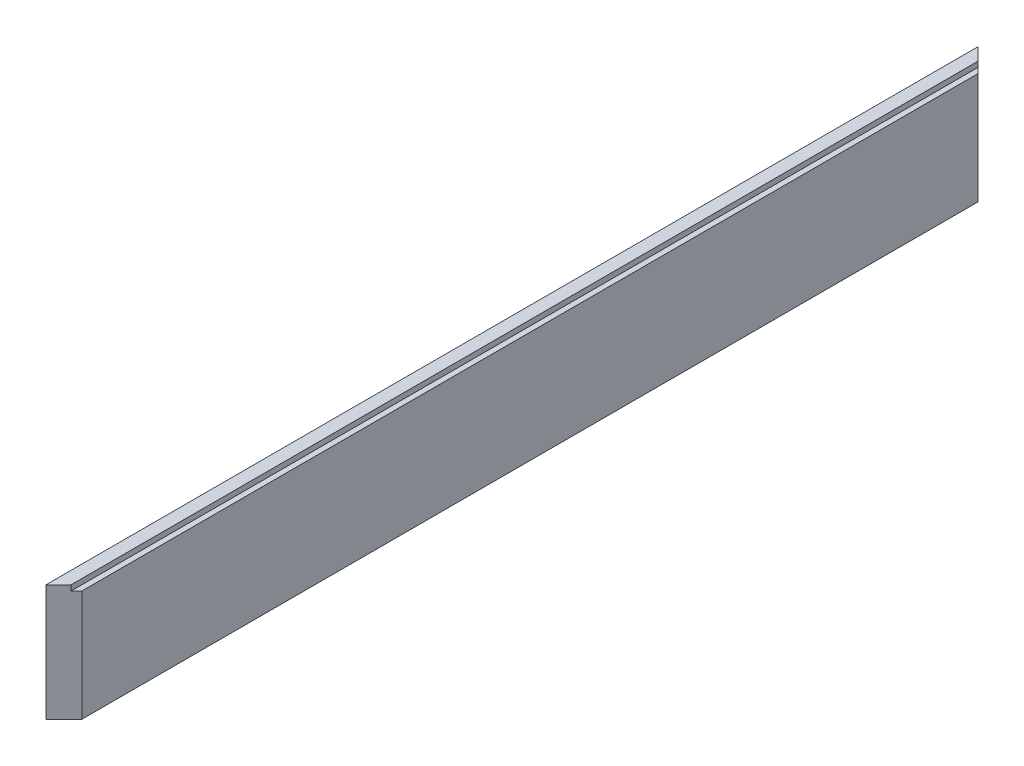
ISO-10303-21;
HEADER;
FILE_DESCRIPTION(('STEP AP214'),'2;1');
FILE_NAME('part.step','',(''),(''),'','','');
FILE_SCHEMA(('AUTOMOTIVE_DESIGN { 1 0 10303 214 1 1 1 1 }'));
ENDSEC;
DATA;
#1=APPLICATION_CONTEXT('core data for automotive mechanical design processes');
#2=APPLICATION_PROTOCOL_DEFINITION('international standard','automotive_design',2000,#1);
#3=PRODUCT_CONTEXT('',#1,'mechanical');
#4=PRODUCT('Part','Part','',(#3));
#5=PRODUCT_RELATED_PRODUCT_CATEGORY('part','',(#4));
#6=PRODUCT_DEFINITION_FORMATION('','',#4);
#7=PRODUCT_DEFINITION_CONTEXT('part definition',#1,'design');
#8=PRODUCT_DEFINITION('design','',#6,#7);
#9=PRODUCT_DEFINITION_SHAPE('','',#8);
#10=(LENGTH_UNIT() NAMED_UNIT(*) SI_UNIT(.MILLI.,.METRE.));
#11=(NAMED_UNIT(*) PLANE_ANGLE_UNIT() SI_UNIT($,.RADIAN.));
#12=(NAMED_UNIT(*) SI_UNIT($,.STERADIAN.) SOLID_ANGLE_UNIT());
#13=UNCERTAINTY_MEASURE_WITH_UNIT(LENGTH_MEASURE(1.E-05),#10,'distance_accuracy_value','');
#14=(GEOMETRIC_REPRESENTATION_CONTEXT(3) GLOBAL_UNCERTAINTY_ASSIGNED_CONTEXT((#13)) GLOBAL_UNIT_ASSIGNED_CONTEXT((#10,
#11,#12)) REPRESENTATION_CONTEXT('',''));
#15=CARTESIAN_POINT('',(0.,0.,0.));
#16=DIRECTION('',(0.,0.,1.));
#17=DIRECTION('',(1.,0.,0.));
#18=AXIS2_PLACEMENT_3D('',#15,#16,#17);
#19=CARTESIAN_POINT('',(10.,0.,520.));
#20=DIRECTION('',(-1.,0.,0.));
#21=DIRECTION('',(0.,0.,1.));
#22=AXIS2_PLACEMENT_3D('',#19,#20,#21);
#23=PLANE('',#22);
#24=DIRECTION('',(0.,0.,-1.));
#25=VECTOR('',#24,1.);
#26=CARTESIAN_POINT('',(10.,62.,520.));
#27=LINE('',#26,#25);
#28=CARTESIAN_POINT('',(10.,62.,510.));
#29=VERTEX_POINT('',#28);
#30=CARTESIAN_POINT('',(10.,62.,10.));
#31=VERTEX_POINT('',#30);
#32=EDGE_CURVE('E47',#29,#31,#27,.T.);
#33=ORIENTED_EDGE('',*,*,#32,.F.);
#34=DIRECTION('',(0.,-1.,0.));
#35=VECTOR('',#34,1.);
#36=CARTESIAN_POINT('',(10.,0.,510.));
#37=LINE('',#36,#35);
#38=CARTESIAN_POINT('',(10.,0.,510.));
#39=VERTEX_POINT('',#38);
#40=EDGE_CURVE('E97',#29,#39,#37,.T.);
#41=ORIENTED_EDGE('',*,*,#40,.T.);
#42=DIRECTION('',(0.,0.,-1.));
#43=VECTOR('',#42,1.);
#44=CARTESIAN_POINT('',(10.,0.,520.));
#45=LINE('',#44,#43);
#46=CARTESIAN_POINT('',(10.,0.,10.));
#47=VERTEX_POINT('',#46);
#48=EDGE_CURVE('E128',#39,#47,#45,.T.);
#49=ORIENTED_EDGE('',*,*,#48,.T.);
#50=DIRECTION('',(0.,1.,0.));
#51=VECTOR('',#50,1.);
#52=CARTESIAN_POINT('',(10.,65.,10.));
#53=LINE('',#52,#51);
#54=EDGE_CURVE('E99',#47,#31,#53,.T.);
#55=ORIENTED_EDGE('',*,*,#54,.T.);
#56=EDGE_LOOP('',(#33,#41,#49,#55));
#57=FACE_BOUND('',#56,.T.);
#58=ADVANCED_FACE('F32',(#57),#23,.F.);
#59=CARTESIAN_POINT('',(0.,65.,520.));
#60=DIRECTION('',(0.,-1.,0.));
#61=DIRECTION('',(0.,0.,-1.));
#62=AXIS2_PLACEMENT_3D('',#59,#60,#61);
#63=PLANE('',#62);
#64=DIRECTION('',(0.,0.,-1.));
#65=VECTOR('',#64,1.);
#66=CARTESIAN_POINT('',(7.,65.,520.));
#67=LINE('',#66,#65);
#68=CARTESIAN_POINT('',(7.,65.,513.));
#69=VERTEX_POINT('',#68);
#70=CARTESIAN_POINT('',(7.,65.,7.00000000000001));
#71=VERTEX_POINT('',#70);
#72=EDGE_CURVE('E93',#69,#71,#67,.T.);
#73=ORIENTED_EDGE('',*,*,#72,.T.);
#74=DIRECTION('',(-0.707106781186549,0.,-0.707106781186546));
#75=VECTOR('',#74,1.);
#76=CARTESIAN_POINT('',(10.,65.,10.));
#77=LINE('',#76,#75);
#78=CARTESIAN_POINT('',(0.,65.,0.));
#79=VERTEX_POINT('',#78);
#80=EDGE_CURVE('E132',#71,#79,#77,.T.);
#81=ORIENTED_EDGE('',*,*,#80,.T.);
#82=DIRECTION('',(0.,0.,-1.));
#83=VECTOR('',#82,1.);
#84=CARTESIAN_POINT('',(0.,65.,520.));
#85=LINE('',#84,#83);
#86=CARTESIAN_POINT('',(0.,65.,520.));
#87=VERTEX_POINT('',#86);
#88=EDGE_CURVE('E123',#87,#79,#85,.T.);
#89=ORIENTED_EDGE('',*,*,#88,.F.);
#90=DIRECTION('',(-0.707106781186548,0.,0.707106781186548));
#91=VECTOR('',#90,1.);
#92=CARTESIAN_POINT('',(0.,65.,520.));
#93=LINE('',#92,#91);
#94=EDGE_CURVE('E107',#87,#69,#93,.F.);
#95=ORIENTED_EDGE('',*,*,#94,.T.);
#96=EDGE_LOOP('',(#73,#81,#89,#95));
#97=FACE_BOUND('',#96,.T.);
#98=ADVANCED_FACE('F136',(#97),#63,.F.);
#99=CARTESIAN_POINT('',(0.,0.,520.));
#100=DIRECTION('',(-0.707106781186547,0.,-0.707106781186547));
#101=DIRECTION('',(0.,1.,0.));
#102=AXIS2_PLACEMENT_3D('',#99,#100,#101);
#103=PLANE('',#102);
#104=DIRECTION('',(0.707106781186548,0.,-0.707106781186548));
#105=VECTOR('',#104,1.);
#106=CARTESIAN_POINT('',(0.,62.,520.));
#107=LINE('',#106,#105);
#108=CARTESIAN_POINT('',(7.,62.,513.));
#109=VERTEX_POINT('',#108);
#110=EDGE_CURVE('E85',#29,#109,#107,.F.);
#111=ORIENTED_EDGE('',*,*,#110,.T.);
#112=DIRECTION('',(0.,-1.,0.));
#113=VECTOR('',#112,1.);
#114=CARTESIAN_POINT('',(6.99999999999998,0.,513.));
#115=LINE('',#114,#113);
#116=EDGE_CURVE('E92',#109,#69,#115,.F.);
#117=ORIENTED_EDGE('',*,*,#116,.T.);
#118=ORIENTED_EDGE('',*,*,#94,.F.);
#119=DIRECTION('',(0.,-1.,0.));
#120=VECTOR('',#119,1.);
#121=CARTESIAN_POINT('',(0.,0.,520.));
#122=LINE('',#121,#120);
#123=CARTESIAN_POINT('',(0.,0.,520.));
#124=VERTEX_POINT('',#123);
#125=EDGE_CURVE('E121',#87,#124,#122,.T.);
#126=ORIENTED_EDGE('',*,*,#125,.T.);
#127=DIRECTION('',(0.707106781186548,0.,-0.707106781186548));
#128=VECTOR('',#127,1.);
#129=CARTESIAN_POINT('',(0.,0.,520.));
#130=LINE('',#129,#128);
#131=EDGE_CURVE('E104',#39,#124,#130,.F.);
#132=ORIENTED_EDGE('',*,*,#131,.F.);
#133=ORIENTED_EDGE('',*,*,#40,.F.);
#134=EDGE_LOOP('',(#111,#117,#118,#126,#132,#133));
#135=FACE_BOUND('',#134,.T.);
#136=ADVANCED_FACE('F102',(#135),#103,.F.);
#137=CARTESIAN_POINT('',(10.,0.,10.));
#138=DIRECTION('',(0.707106781186545,0.,-0.707106781186549));
#139=DIRECTION('',(0.,-1.,0.));
#140=AXIS2_PLACEMENT_3D('',#137,#138,#139);
#141=PLANE('',#140);
#142=ORIENTED_EDGE('',*,*,#80,.F.);
#143=DIRECTION('',(0.,-1.,0.));
#144=VECTOR('',#143,1.);
#145=CARTESIAN_POINT('',(6.99999999999998,0.,7.00000000000001));
#146=LINE('',#145,#144);
#147=CARTESIAN_POINT('',(7.,62.,7.00000000000001));
#148=VERTEX_POINT('',#147);
#149=EDGE_CURVE('E11',#71,#148,#146,.T.);
#150=ORIENTED_EDGE('',*,*,#149,.T.);
#151=DIRECTION('',(0.707106781186549,0.,0.707106781186546));
#152=VECTOR('',#151,1.);
#153=CARTESIAN_POINT('',(10.,62.,10.));
#154=LINE('',#153,#152);
#155=EDGE_CURVE('E40',#148,#31,#154,.T.);
#156=ORIENTED_EDGE('',*,*,#155,.T.);
#157=ORIENTED_EDGE('',*,*,#54,.F.);
#158=DIRECTION('',(0.707106781186549,0.,0.707106781186546));
#159=VECTOR('',#158,1.);
#160=CARTESIAN_POINT('',(10.,0.,10.));
#161=LINE('',#160,#159);
#162=CARTESIAN_POINT('',(0.,0.,0.));
#163=VERTEX_POINT('',#162);
#164=EDGE_CURVE('E55',#163,#47,#161,.T.);
#165=ORIENTED_EDGE('',*,*,#164,.F.);
#166=DIRECTION('',(0.,-1.,0.));
#167=VECTOR('',#166,1.);
#168=CARTESIAN_POINT('',(0.,0.,0.));
#169=LINE('',#168,#167);
#170=EDGE_CURVE('E120',#79,#163,#169,.T.);
#171=ORIENTED_EDGE('',*,*,#170,.F.);
#172=EDGE_LOOP('',(#142,#150,#156,#157,#165,#171));
#173=FACE_BOUND('',#172,.T.);
#174=ADVANCED_FACE('F34',(#173),#141,.T.);
#175=CARTESIAN_POINT('',(0.,0.,520.));
#176=DIRECTION('',(1.,0.,0.));
#177=DIRECTION('',(0.,0.,-1.));
#178=AXIS2_PLACEMENT_3D('',#175,#176,#177);
#179=PLANE('',#178);
#180=ORIENTED_EDGE('',*,*,#170,.T.);
#181=DIRECTION('',(0.,0.,-1.));
#182=VECTOR('',#181,1.);
#183=CARTESIAN_POINT('',(0.,0.,520.));
#184=LINE('',#183,#182);
#185=EDGE_CURVE('E130',#124,#163,#184,.T.);
#186=ORIENTED_EDGE('',*,*,#185,.F.);
#187=ORIENTED_EDGE('',*,*,#125,.F.);
#188=ORIENTED_EDGE('',*,*,#88,.T.);
#189=EDGE_LOOP('',(#180,#186,#187,#188));
#190=FACE_BOUND('',#189,.T.);
#191=ADVANCED_FACE('F140',(#190),#179,.F.);
#192=CARTESIAN_POINT('',(0.,0.,520.));
#193=DIRECTION('',(0.,1.,0.));
#194=DIRECTION('',(0.,0.,1.));
#195=AXIS2_PLACEMENT_3D('',#192,#193,#194);
#196=PLANE('',#195);
#197=ORIENTED_EDGE('',*,*,#48,.F.);
#198=ORIENTED_EDGE('',*,*,#131,.T.);
#199=ORIENTED_EDGE('',*,*,#185,.T.);
#200=ORIENTED_EDGE('',*,*,#164,.T.);
#201=EDGE_LOOP('',(#197,#198,#199,#200));
#202=FACE_BOUND('',#201,.T.);
#203=ADVANCED_FACE('F142',(#202),#196,.F.);
#204=CARTESIAN_POINT('',(7.,65.,520.));
#205=DIRECTION('',(1.,0.,0.));
#206=DIRECTION('',(0.,1.,0.));
#207=AXIS2_PLACEMENT_3D('',#204,#205,#206);
#208=PLANE('',#207);
#209=DIRECTION('',(0.,0.,-1.));
#210=VECTOR('',#209,1.);
#211=CARTESIAN_POINT('',(7.,62.,520.));
#212=LINE('',#211,#210);
#213=EDGE_CURVE('E88',#109,#148,#212,.T.);
#214=ORIENTED_EDGE('',*,*,#213,.T.);
#215=ORIENTED_EDGE('',*,*,#149,.F.);
#216=ORIENTED_EDGE('',*,*,#72,.F.);
#217=ORIENTED_EDGE('',*,*,#116,.F.);
#218=EDGE_LOOP('',(#214,#215,#216,#217));
#219=FACE_BOUND('',#218,.T.);
#220=ADVANCED_FACE('F114',(#219),#208,.T.);
#221=CARTESIAN_POINT('',(10.,62.,520.));
#222=DIRECTION('',(0.,1.,0.));
#223=DIRECTION('',(0.,0.,1.));
#224=AXIS2_PLACEMENT_3D('',#221,#222,#223);
#225=PLANE('',#224);
#226=ORIENTED_EDGE('',*,*,#32,.T.);
#227=ORIENTED_EDGE('',*,*,#155,.F.);
#228=ORIENTED_EDGE('',*,*,#213,.F.);
#229=ORIENTED_EDGE('',*,*,#110,.F.);
#230=EDGE_LOOP('',(#226,#227,#228,#229));
#231=FACE_BOUND('',#230,.T.);
#232=ADVANCED_FACE('F86',(#231),#225,.T.);
#233=CLOSED_SHELL('',(#58,#98,#136,#174,#191,#203,#220,#232));
#234=MANIFOLD_SOLID_BREP('B2',#233);
#235=ADVANCED_BREP_SHAPE_REPRESENTATION('',(#18,#234),#14);
#236=SHAPE_DEFINITION_REPRESENTATION(#9,#235);
ENDSEC;
END-ISO-10303-21;
